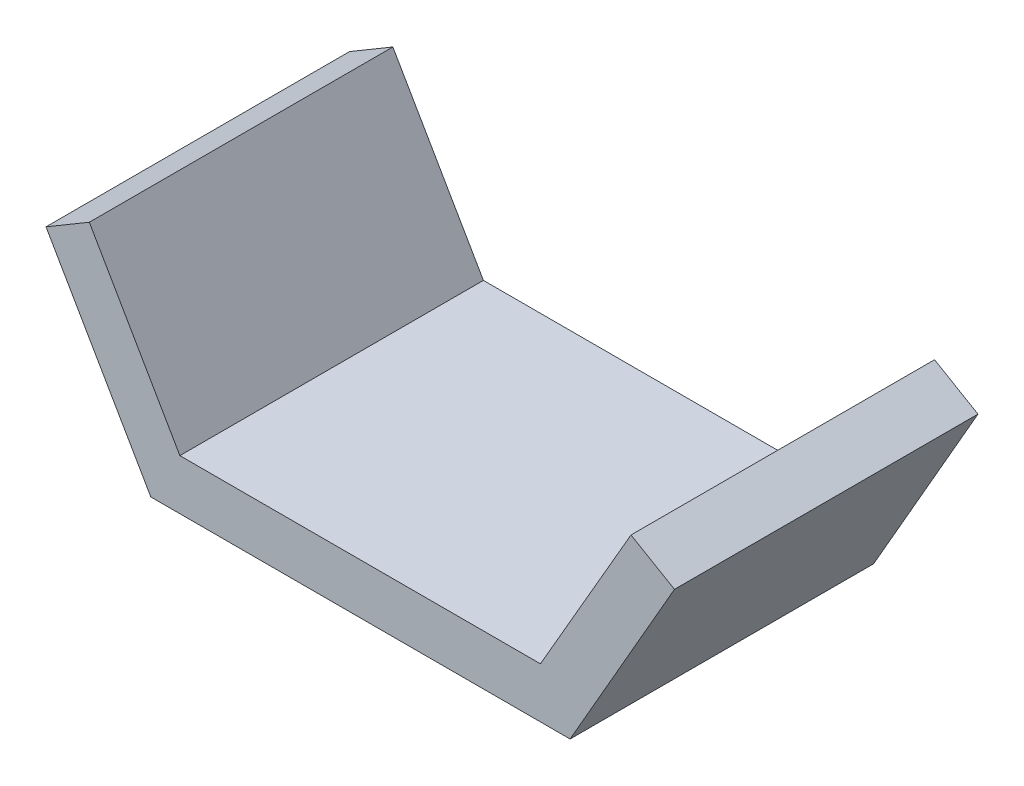
ISO-10303-21;
HEADER;
FILE_DESCRIPTION(('STEP AP214'),'2;1');
FILE_NAME('part.step','',(''),(''),'','','');
FILE_SCHEMA(('AUTOMOTIVE_DESIGN { 1 0 10303 214 1 1 1 1 }'));
ENDSEC;
DATA;
#1=APPLICATION_CONTEXT('core data for automotive mechanical design processes');
#2=APPLICATION_PROTOCOL_DEFINITION('international standard','automotive_design',2000,#1);
#3=PRODUCT_CONTEXT('',#1,'mechanical');
#4=PRODUCT('Part','Part','',(#3));
#5=PRODUCT_RELATED_PRODUCT_CATEGORY('part','',(#4));
#6=PRODUCT_DEFINITION_FORMATION('','',#4);
#7=PRODUCT_DEFINITION_CONTEXT('part definition',#1,'design');
#8=PRODUCT_DEFINITION('design','',#6,#7);
#9=PRODUCT_DEFINITION_SHAPE('','',#8);
#10=(LENGTH_UNIT() NAMED_UNIT(*) SI_UNIT(.MILLI.,.METRE.));
#11=(NAMED_UNIT(*) PLANE_ANGLE_UNIT() SI_UNIT($,.RADIAN.));
#12=(NAMED_UNIT(*) SI_UNIT($,.STERADIAN.) SOLID_ANGLE_UNIT());
#13=UNCERTAINTY_MEASURE_WITH_UNIT(LENGTH_MEASURE(1.E-05),#10,'distance_accuracy_value','');
#14=(GEOMETRIC_REPRESENTATION_CONTEXT(3) GLOBAL_UNCERTAINTY_ASSIGNED_CONTEXT((#13)) GLOBAL_UNIT_ASSIGNED_CONTEXT((#10,
#11,#12)) REPRESENTATION_CONTEXT('',''));
#15=CARTESIAN_POINT('',(0.,0.,0.));
#16=DIRECTION('',(0.,0.,1.));
#17=DIRECTION('',(1.,0.,0.));
#18=AXIS2_PLACEMENT_3D('',#15,#16,#17);
#19=CARTESIAN_POINT('',(-113.345721283557,-408.189274436975,1810.));
#20=DIRECTION('',(-0.866025403784436,-0.500000000000004,0.));
#21=DIRECTION('',(0.500000000000004,-0.866025403784436,0.));
#22=AXIS2_PLACEMENT_3D('',#19,#20,#21);
#23=PLANE('',#22);
#24=DIRECTION('',(-0.500000000000004,0.866025403784436,0.));
#25=VECTOR('',#24,1.);
#26=CARTESIAN_POINT('',(-113.345721283557,-408.189274436975,0.));
#27=LINE('',#26,#25);
#28=CARTESIAN_POINT('',(-113.345721283557,-408.189274436975,0.));
#29=VERTEX_POINT('',#28);
#30=CARTESIAN_POINT('',(-653.345721283561,527.118161650216,0.));
#31=VERTEX_POINT('',#30);
#32=EDGE_CURVE('E140',#29,#31,#27,.T.);
#33=ORIENTED_EDGE('',*,*,#32,.T.);
#34=DIRECTION('',(0.,0.,-1.));
#35=VECTOR('',#34,1.);
#36=CARTESIAN_POINT('',(-653.345721283561,527.118161650216,1810.));
#37=LINE('',#36,#35);
#38=CARTESIAN_POINT('',(-653.345721283561,527.118161650216,1810.));
#39=VERTEX_POINT('',#38);
#40=EDGE_CURVE('E11',#39,#31,#37,.T.);
#41=ORIENTED_EDGE('',*,*,#40,.F.);
#42=DIRECTION('',(-0.500000000000004,0.866025403784436,0.));
#43=VECTOR('',#42,1.);
#44=CARTESIAN_POINT('',(-113.345721283557,-408.189274436975,1810.));
#45=LINE('',#44,#43);
#46=CARTESIAN_POINT('',(-113.345721283557,-408.189274436975,1810.));
#47=VERTEX_POINT('',#46);
#48=EDGE_CURVE('E162',#47,#39,#45,.T.);
#49=ORIENTED_EDGE('',*,*,#48,.F.);
#50=DIRECTION('',(0.,0.,-1.));
#51=VECTOR('',#50,1.);
#52=CARTESIAN_POINT('',(-113.345721283557,-408.189274436975,1810.));
#53=LINE('',#52,#51);
#54=EDGE_CURVE('E136',#47,#29,#53,.T.);
#55=ORIENTED_EDGE('',*,*,#54,.T.);
#56=EDGE_LOOP('',(#33,#41,#49,#55));
#57=FACE_BOUND('',#56,.T.);
#58=ADVANCED_FACE('F39',(#57),#23,.F.);
#59=CARTESIAN_POINT('',(-653.345721283561,527.118161650216,1810.));
#60=DIRECTION('',(0.50922321081161,-0.86063448778835,0.));
#61=DIRECTION('',(0.86063448778835,0.50922321081161,0.));
#62=AXIS2_PLACEMENT_3D('',#59,#60,#61);
#63=PLANE('',#62);
#64=DIRECTION('',(-0.86063448778835,-0.50922321081161,0.));
#65=VECTOR('',#64,1.);
#66=CARTESIAN_POINT('',(-653.345721283561,527.118161650216,0.));
#67=LINE('',#66,#65);
#68=CARTESIAN_POINT('',(-911.550802040449,374.34248029357,0.));
#69=VERTEX_POINT('',#68);
#70=EDGE_CURVE('E144',#31,#69,#67,.T.);
#71=ORIENTED_EDGE('',*,*,#70,.T.);
#72=DIRECTION('',(0.,0.,-1.));
#73=VECTOR('',#72,1.);
#74=CARTESIAN_POINT('',(-911.550802040449,374.34248029357,1810.));
#75=LINE('',#74,#73);
#76=CARTESIAN_POINT('',(-911.550802040449,374.34248029357,1810.));
#77=VERTEX_POINT('',#76);
#78=EDGE_CURVE('E48',#77,#69,#75,.T.);
#79=ORIENTED_EDGE('',*,*,#78,.F.);
#80=DIRECTION('',(-0.86063448778835,-0.50922321081161,0.));
#81=VECTOR('',#80,1.);
#82=CARTESIAN_POINT('',(-653.345721283561,527.118161650216,1810.));
#83=LINE('',#82,#81);
#84=EDGE_CURVE('E99',#39,#77,#83,.T.);
#85=ORIENTED_EDGE('',*,*,#84,.F.);
#86=ORIENTED_EDGE('',*,*,#40,.T.);
#87=EDGE_LOOP('',(#71,#79,#85,#86));
#88=FACE_BOUND('',#87,.T.);
#89=ADVANCED_FACE('F208',(#88),#63,.F.);
#90=CARTESIAN_POINT('',(-911.550802040449,374.34248029357,1810.));
#91=DIRECTION('',(0.866025403784436,0.500000000000005,0.));
#92=DIRECTION('',(-0.500000000000005,0.866025403784436,0.));
#93=AXIS2_PLACEMENT_3D('',#90,#91,#92);
#94=PLANE('',#93);
#95=DIRECTION('',(0.500000000000005,-0.866025403784436,0.));
#96=VECTOR('',#95,1.);
#97=CARTESIAN_POINT('',(-911.550802040449,374.34248029357,0.));
#98=LINE('',#97,#96);
#99=CARTESIAN_POINT('',(-286.550802040443,-708.189274436975,0.));
#100=VERTEX_POINT('',#99);
#101=EDGE_CURVE('E147',#69,#100,#98,.T.);
#102=ORIENTED_EDGE('',*,*,#101,.T.);
#103=DIRECTION('',(0.,0.,-1.));
#104=VECTOR('',#103,1.);
#105=CARTESIAN_POINT('',(-286.550802040443,-708.189274436975,1810.));
#106=LINE('',#105,#104);
#107=CARTESIAN_POINT('',(-286.550802040443,-708.189274436975,1810.));
#108=VERTEX_POINT('',#107);
#109=EDGE_CURVE('E173',#108,#100,#106,.T.);
#110=ORIENTED_EDGE('',*,*,#109,.F.);
#111=DIRECTION('',(0.500000000000005,-0.866025403784436,0.));
#112=VECTOR('',#111,1.);
#113=CARTESIAN_POINT('',(-911.550802040449,374.34248029357,1810.));
#114=LINE('',#113,#112);
#115=EDGE_CURVE('E183',#77,#108,#114,.T.);
#116=ORIENTED_EDGE('',*,*,#115,.F.);
#117=ORIENTED_EDGE('',*,*,#78,.T.);
#118=EDGE_LOOP('',(#102,#110,#116,#117));
#119=FACE_BOUND('',#118,.T.);
#120=ADVANCED_FACE('F181',(#119),#94,.F.);
#121=CARTESIAN_POINT('',(-286.550802040443,-708.189274436975,1810.));
#122=DIRECTION('',(0.,1.,0.));
#123=DIRECTION('',(-1.,0.,0.));
#124=AXIS2_PLACEMENT_3D('',#121,#122,#123);
#125=PLANE('',#124);
#126=DIRECTION('',(1.,0.,0.));
#127=VECTOR('',#126,1.);
#128=CARTESIAN_POINT('',(-286.550802040443,-708.189274436975,0.));
#129=LINE('',#128,#127);
#130=CARTESIAN_POINT('',(2213.44919795956,-708.189274436975,0.));
#131=VERTEX_POINT('',#130);
#132=EDGE_CURVE('E150',#100,#131,#129,.T.);
#133=ORIENTED_EDGE('',*,*,#132,.T.);
#134=DIRECTION('',(0.,0.,-1.));
#135=VECTOR('',#134,1.);
#136=CARTESIAN_POINT('',(2213.44919795956,-708.189274436975,1810.));
#137=LINE('',#136,#135);
#138=CARTESIAN_POINT('',(2213.44919795956,-708.189274436975,1810.));
#139=VERTEX_POINT('',#138);
#140=EDGE_CURVE('E169',#139,#131,#137,.T.);
#141=ORIENTED_EDGE('',*,*,#140,.F.);
#142=DIRECTION('',(1.,0.,0.));
#143=VECTOR('',#142,1.);
#144=CARTESIAN_POINT('',(-286.550802040443,-708.189274436975,1810.));
#145=LINE('',#144,#143);
#146=EDGE_CURVE('E196',#108,#139,#145,.T.);
#147=ORIENTED_EDGE('',*,*,#146,.F.);
#148=ORIENTED_EDGE('',*,*,#109,.T.);
#149=EDGE_LOOP('',(#133,#141,#147,#148));
#150=FACE_BOUND('',#149,.T.);
#151=ADVANCED_FACE('F191',(#150),#125,.F.);
#152=CARTESIAN_POINT('',(2213.44919795956,-708.189274436975,1810.));
#153=DIRECTION('',(-0.867267609070181,0.497842238322234,0.));
#154=DIRECTION('',(-0.497842238322234,-0.867267609070181,0.));
#155=AXIS2_PLACEMENT_3D('',#152,#153,#154);
#156=PLANE('',#155);
#157=DIRECTION('',(0.497842238322234,0.867267609070181,0.));
#158=VECTOR('',#157,1.);
#159=CARTESIAN_POINT('',(2213.44919795956,-708.189274436975,0.));
#160=LINE('',#159,#158);
#161=CARTESIAN_POINT('',(2835.75199586235,375.895236900751,0.));
#162=VERTEX_POINT('',#161);
#163=EDGE_CURVE('E153',#131,#162,#160,.T.);
#164=ORIENTED_EDGE('',*,*,#163,.T.);
#165=DIRECTION('',(0.,0.,-1.));
#166=VECTOR('',#165,1.);
#167=CARTESIAN_POINT('',(2835.75199586235,375.895236900751,1810.));
#168=LINE('',#167,#166);
#169=CARTESIAN_POINT('',(2835.75199586235,375.895236900751,1810.));
#170=VERTEX_POINT('',#169);
#171=EDGE_CURVE('E129',#170,#162,#168,.T.);
#172=ORIENTED_EDGE('',*,*,#171,.F.);
#173=DIRECTION('',(0.497842238322234,0.867267609070181,0.));
#174=VECTOR('',#173,1.);
#175=CARTESIAN_POINT('',(2213.44919795956,-708.189274436975,1810.));
#176=LINE('',#175,#174);
#177=EDGE_CURVE('E118',#139,#170,#176,.T.);
#178=ORIENTED_EDGE('',*,*,#177,.F.);
#179=ORIENTED_EDGE('',*,*,#140,.T.);
#180=EDGE_LOOP('',(#164,#172,#178,#179));
#181=FACE_BOUND('',#180,.T.);
#182=ADVANCED_FACE('F194',(#181),#156,.F.);
#183=CARTESIAN_POINT('',(2835.75199586235,375.895236900751,1810.));
#184=DIRECTION('',(-0.504076415831551,-0.863659057153005,0.));
#185=DIRECTION('',(0.863659057153005,-0.504076415831551,0.));
#186=AXIS2_PLACEMENT_3D('',#183,#184,#185);
#187=PLANE('',#186);
#188=DIRECTION('',(-0.863659057153005,0.504076415831551,0.));
#189=VECTOR('',#188,1.);
#190=CARTESIAN_POINT('',(2835.75199586235,375.895236900751,0.));
#191=LINE('',#190,#189);
#192=CARTESIAN_POINT('',(2576.65427871645,527.118161650216,0.));
#193=VERTEX_POINT('',#192);
#194=EDGE_CURVE('E127',#162,#193,#191,.T.);
#195=ORIENTED_EDGE('',*,*,#194,.T.);
#196=DIRECTION('',(0.,0.,-1.));
#197=VECTOR('',#196,1.);
#198=CARTESIAN_POINT('',(2576.65427871645,527.118161650216,1810.));
#199=LINE('',#198,#197);
#200=CARTESIAN_POINT('',(2576.65427871645,527.118161650216,1810.));
#201=VERTEX_POINT('',#200);
#202=EDGE_CURVE('E124',#201,#193,#199,.T.);
#203=ORIENTED_EDGE('',*,*,#202,.F.);
#204=DIRECTION('',(-0.863659057153005,0.504076415831551,0.));
#205=VECTOR('',#204,1.);
#206=CARTESIAN_POINT('',(2835.75199586235,375.895236900751,1810.));
#207=LINE('',#206,#205);
#208=EDGE_CURVE('E112',#170,#201,#207,.T.);
#209=ORIENTED_EDGE('',*,*,#208,.F.);
#210=ORIENTED_EDGE('',*,*,#171,.T.);
#211=EDGE_LOOP('',(#195,#203,#209,#210));
#212=FACE_BOUND('',#211,.T.);
#213=ADVANCED_FACE('F125',(#212),#187,.F.);
#214=CARTESIAN_POINT('',(2576.65427871645,527.118161650216,1810.));
#215=DIRECTION('',(0.866025403784436,-0.500000000000004,0.));
#216=DIRECTION('',(0.500000000000004,0.866025403784436,0.));
#217=AXIS2_PLACEMENT_3D('',#214,#215,#216);
#218=PLANE('',#217);
#219=DIRECTION('',(-0.500000000000004,-0.866025403784436,0.));
#220=VECTOR('',#219,1.);
#221=CARTESIAN_POINT('',(2576.65427871645,527.118161650216,0.));
#222=LINE('',#221,#220);
#223=CARTESIAN_POINT('',(2036.65427871644,-408.189274436975,0.));
#224=VERTEX_POINT('',#223);
#225=EDGE_CURVE('E85',#193,#224,#222,.T.);
#226=ORIENTED_EDGE('',*,*,#225,.T.);
#227=DIRECTION('',(0.,0.,-1.));
#228=VECTOR('',#227,1.);
#229=CARTESIAN_POINT('',(2036.65427871644,-408.189274436975,1810.));
#230=LINE('',#229,#228);
#231=CARTESIAN_POINT('',(2036.65427871644,-408.189274436975,1810.));
#232=VERTEX_POINT('',#231);
#233=EDGE_CURVE('E130',#232,#224,#230,.T.);
#234=ORIENTED_EDGE('',*,*,#233,.F.);
#235=DIRECTION('',(-0.500000000000004,-0.866025403784436,0.));
#236=VECTOR('',#235,1.);
#237=CARTESIAN_POINT('',(2576.65427871645,527.118161650216,1810.));
#238=LINE('',#237,#236);
#239=EDGE_CURVE('E116',#201,#232,#238,.T.);
#240=ORIENTED_EDGE('',*,*,#239,.F.);
#241=ORIENTED_EDGE('',*,*,#202,.T.);
#242=EDGE_LOOP('',(#226,#234,#240,#241));
#243=FACE_BOUND('',#242,.T.);
#244=ADVANCED_FACE('F132',(#243),#218,.F.);
#245=CARTESIAN_POINT('',(-113.345721283557,-408.189274436975,1810.));
#246=DIRECTION('',(0.,-1.,0.));
#247=DIRECTION('',(1.,0.,0.));
#248=AXIS2_PLACEMENT_3D('',#245,#246,#247);
#249=PLANE('',#248);
#250=DIRECTION('',(-1.,0.,0.));
#251=VECTOR('',#250,1.);
#252=CARTESIAN_POINT('',(-113.345721283557,-408.189274436975,0.));
#253=LINE('',#252,#251);
#254=EDGE_CURVE('E91',#224,#29,#253,.T.);
#255=ORIENTED_EDGE('',*,*,#254,.T.);
#256=ORIENTED_EDGE('',*,*,#54,.F.);
#257=DIRECTION('',(-1.,0.,0.));
#258=VECTOR('',#257,1.);
#259=CARTESIAN_POINT('',(-113.345721283557,-408.189274436975,1810.));
#260=LINE('',#259,#258);
#261=EDGE_CURVE('E56',#232,#47,#260,.T.);
#262=ORIENTED_EDGE('',*,*,#261,.F.);
#263=ORIENTED_EDGE('',*,*,#233,.T.);
#264=EDGE_LOOP('',(#255,#256,#262,#263));
#265=FACE_BOUND('',#264,.T.);
#266=ADVANCED_FACE('F224',(#265),#249,.F.);
#267=CARTESIAN_POINT('',(0.,0.,1810.));
#268=DIRECTION('',(0.,0.,1.));
#269=DIRECTION('',(1.,0.,0.));
#270=AXIS2_PLACEMENT_3D('',#267,#268,#269);
#271=PLANE('',#270);
#272=ORIENTED_EDGE('',*,*,#48,.T.);
#273=ORIENTED_EDGE('',*,*,#84,.T.);
#274=ORIENTED_EDGE('',*,*,#115,.T.);
#275=ORIENTED_EDGE('',*,*,#146,.T.);
#276=ORIENTED_EDGE('',*,*,#177,.T.);
#277=ORIENTED_EDGE('',*,*,#208,.T.);
#278=ORIENTED_EDGE('',*,*,#239,.T.);
#279=ORIENTED_EDGE('',*,*,#261,.T.);
#280=EDGE_LOOP('',(#272,#273,#274,#275,#276,#277,#278,#279));
#281=FACE_BOUND('',#280,.T.);
#282=ADVANCED_FACE('F114',(#281),#271,.T.);
#283=CARTESIAN_POINT('',(0.,0.,0.));
#284=DIRECTION('',(0.,0.,1.));
#285=DIRECTION('',(1.,0.,0.));
#286=AXIS2_PLACEMENT_3D('',#283,#284,#285);
#287=PLANE('',#286);
#288=ORIENTED_EDGE('',*,*,#32,.F.);
#289=ORIENTED_EDGE('',*,*,#254,.F.);
#290=ORIENTED_EDGE('',*,*,#225,.F.);
#291=ORIENTED_EDGE('',*,*,#194,.F.);
#292=ORIENTED_EDGE('',*,*,#163,.F.);
#293=ORIENTED_EDGE('',*,*,#132,.F.);
#294=ORIENTED_EDGE('',*,*,#101,.F.);
#295=ORIENTED_EDGE('',*,*,#70,.F.);
#296=EDGE_LOOP('',(#288,#289,#290,#291,#292,#293,#294,#295));
#297=FACE_BOUND('',#296,.T.);
#298=ADVANCED_FACE('F187',(#297),#287,.F.);
#299=CLOSED_SHELL('',(#58,#89,#120,#151,#182,#213,#244,#266,#282,#298));
#300=MANIFOLD_SOLID_BREP('B2',#299);
#301=ADVANCED_BREP_SHAPE_REPRESENTATION('',(#18,#300),#14);
#302=SHAPE_DEFINITION_REPRESENTATION(#9,#301);
ENDSEC;
END-ISO-10303-21;
